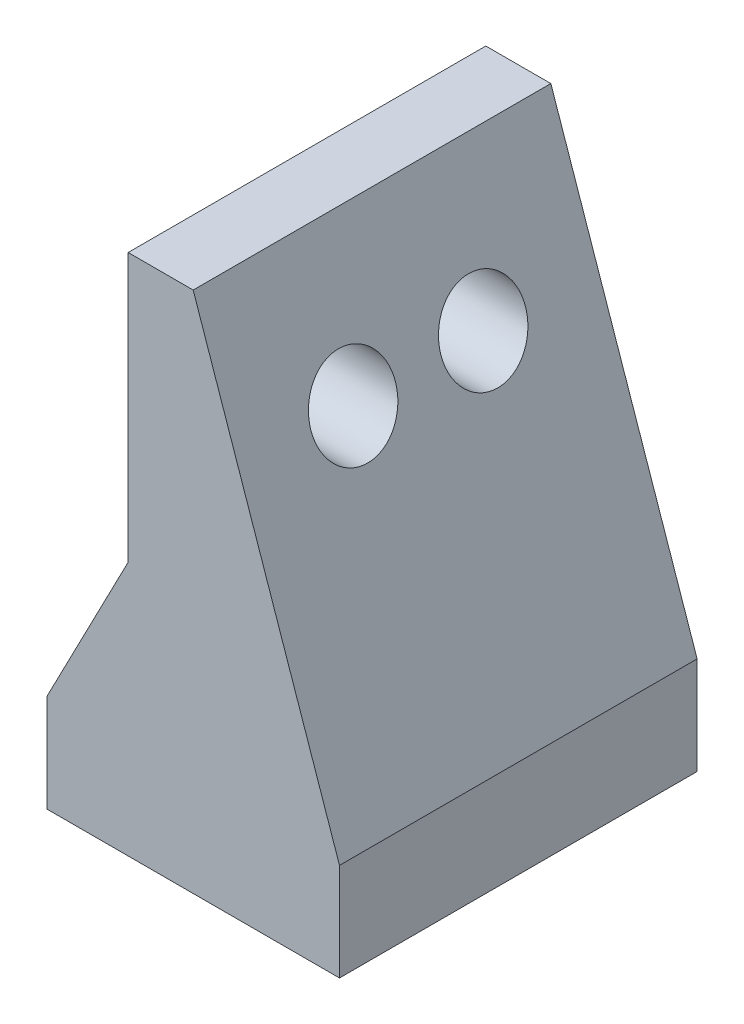
ISO-10303-21;
HEADER;
FILE_DESCRIPTION(('STEP AP214'),'2;1');
FILE_NAME('part.step','',(''),(''),'','','');
FILE_SCHEMA(('AUTOMOTIVE_DESIGN { 1 0 10303 214 1 1 1 1 }'));
ENDSEC;
DATA;
#1=APPLICATION_CONTEXT('core data for automotive mechanical design processes');
#2=APPLICATION_PROTOCOL_DEFINITION('international standard','automotive_design',2000,#1);
#3=PRODUCT_CONTEXT('',#1,'mechanical');
#4=PRODUCT('Part','Part','',(#3));
#5=PRODUCT_RELATED_PRODUCT_CATEGORY('part','',(#4));
#6=PRODUCT_DEFINITION_FORMATION('','',#4);
#7=PRODUCT_DEFINITION_CONTEXT('part definition',#1,'design');
#8=PRODUCT_DEFINITION('design','',#6,#7);
#9=PRODUCT_DEFINITION_SHAPE('','',#8);
#10=(LENGTH_UNIT() NAMED_UNIT(*) SI_UNIT(.MILLI.,.METRE.));
#11=(NAMED_UNIT(*) PLANE_ANGLE_UNIT() SI_UNIT($,.RADIAN.));
#12=(NAMED_UNIT(*) SI_UNIT($,.STERADIAN.) SOLID_ANGLE_UNIT());
#13=UNCERTAINTY_MEASURE_WITH_UNIT(LENGTH_MEASURE(1.E-05),#10,'distance_accuracy_value','');
#14=(GEOMETRIC_REPRESENTATION_CONTEXT(3) GLOBAL_UNCERTAINTY_ASSIGNED_CONTEXT((#13)) GLOBAL_UNIT_ASSIGNED_CONTEXT((#10,
#11,#12)) REPRESENTATION_CONTEXT('',''));
#15=CARTESIAN_POINT('',(0.,0.,0.));
#16=DIRECTION('',(0.,0.,1.));
#17=DIRECTION('',(1.,0.,0.));
#18=AXIS2_PLACEMENT_3D('',#15,#16,#17);
#19=CARTESIAN_POINT('',(18.,0.,22.));
#20=DIRECTION('',(0.,1.,0.));
#21=DIRECTION('',(-1.,0.,0.));
#22=AXIS2_PLACEMENT_3D('',#19,#20,#21);
#23=PLANE('',#22);
#24=CARTESIAN_POINT('',(13.,0.,11.));
#25=DIRECTION('',(0.,1.,0.));
#26=DIRECTION('',(-1.,0.,0.));
#27=AXIS2_PLACEMENT_3D('',#24,#25,#26);
#28=CIRCLE('',#27,3.6);
#29=CARTESIAN_POINT('',(9.4,0.,11.));
#30=VERTEX_POINT('',#29);
#31=EDGE_CURVE('E159',#30,#30,#28,.T.);
#32=ORIENTED_EDGE('',*,*,#31,.T.);
#33=EDGE_LOOP('',(#32));
#34=FACE_BOUND('',#33,.T.);
#35=CARTESIAN_POINT('',(5.,0.,17.));
#36=DIRECTION('',(0.,1.,0.));
#37=DIRECTION('',(-1.,0.,0.));
#38=AXIS2_PLACEMENT_3D('',#35,#36,#37);
#39=CIRCLE('',#38,3.59999999999999);
#40=CARTESIAN_POINT('',(1.40000000000001,0.,17.));
#41=VERTEX_POINT('',#40);
#42=EDGE_CURVE('E156',#41,#41,#39,.T.);
#43=ORIENTED_EDGE('',*,*,#42,.T.);
#44=EDGE_LOOP('',(#43));
#45=FACE_BOUND('',#44,.T.);
#46=CARTESIAN_POINT('',(5.,0.,5.));
#47=DIRECTION('',(0.,1.,0.));
#48=DIRECTION('',(-1.,0.,0.));
#49=AXIS2_PLACEMENT_3D('',#46,#47,#48);
#50=CIRCLE('',#49,3.6);
#51=CARTESIAN_POINT('',(1.4,0.,5.));
#52=VERTEX_POINT('',#51);
#53=EDGE_CURVE('E153',#52,#52,#50,.T.);
#54=ORIENTED_EDGE('',*,*,#53,.T.);
#55=EDGE_LOOP('',(#54));
#56=FACE_BOUND('',#55,.T.);
#57=DIRECTION('',(1.,0.,0.));
#58=VECTOR('',#57,1.);
#59=CARTESIAN_POINT('',(18.,0.,0.));
#60=LINE('',#59,#58);
#61=CARTESIAN_POINT('',(0.,0.,0.));
#62=VERTEX_POINT('',#61);
#63=CARTESIAN_POINT('',(18.,0.,0.));
#64=VERTEX_POINT('',#63);
#65=EDGE_CURVE('E125',#62,#64,#60,.T.);
#66=ORIENTED_EDGE('',*,*,#65,.T.);
#67=DIRECTION('',(0.,0.,-1.));
#68=VECTOR('',#67,1.);
#69=CARTESIAN_POINT('',(18.,0.,22.));
#70=LINE('',#69,#68);
#71=CARTESIAN_POINT('',(18.,0.,22.));
#72=VERTEX_POINT('',#71);
#73=EDGE_CURVE('E148',#72,#64,#70,.T.);
#74=ORIENTED_EDGE('',*,*,#73,.F.);
#75=DIRECTION('',(1.,0.,0.));
#76=VECTOR('',#75,1.);
#77=CARTESIAN_POINT('',(18.,0.,22.));
#78=LINE('',#77,#76);
#79=CARTESIAN_POINT('',(0.,0.,22.));
#80=VERTEX_POINT('',#79);
#81=EDGE_CURVE('E138',#80,#72,#78,.T.);
#82=ORIENTED_EDGE('',*,*,#81,.F.);
#83=DIRECTION('',(0.,0.,-1.));
#84=VECTOR('',#83,1.);
#85=CARTESIAN_POINT('',(0.,0.,22.));
#86=LINE('',#85,#84);
#87=EDGE_CURVE('E121',#80,#62,#86,.T.);
#88=ORIENTED_EDGE('',*,*,#87,.T.);
#89=EDGE_LOOP('',(#66,#74,#82,#88));
#90=FACE_BOUND('',#89,.T.);
#91=ADVANCED_FACE('F33',(#34,#45,#56,#90),#23,.F.);
#92=CARTESIAN_POINT('',(18.,6.,22.));
#93=DIRECTION('',(-1.,0.,0.));
#94=DIRECTION('',(0.,0.,1.));
#95=AXIS2_PLACEMENT_3D('',#92,#93,#94);
#96=PLANE('',#95);
#97=DIRECTION('',(0.,1.,0.));
#98=VECTOR('',#97,1.);
#99=CARTESIAN_POINT('',(18.,6.,0.));
#100=LINE('',#99,#98);
#101=CARTESIAN_POINT('',(18.,6.,0.));
#102=VERTEX_POINT('',#101);
#103=EDGE_CURVE('E128',#64,#102,#100,.T.);
#104=ORIENTED_EDGE('',*,*,#103,.T.);
#105=DIRECTION('',(0.,0.,-1.));
#106=VECTOR('',#105,1.);
#107=CARTESIAN_POINT('',(18.,6.,22.));
#108=LINE('',#107,#106);
#109=CARTESIAN_POINT('',(18.,6.,22.));
#110=VERTEX_POINT('',#109);
#111=EDGE_CURVE('E145',#110,#102,#108,.T.);
#112=ORIENTED_EDGE('',*,*,#111,.F.);
#113=DIRECTION('',(0.,1.,0.));
#114=VECTOR('',#113,1.);
#115=CARTESIAN_POINT('',(18.,6.,22.));
#116=LINE('',#115,#114);
#117=EDGE_CURVE('E91',#72,#110,#116,.T.);
#118=ORIENTED_EDGE('',*,*,#117,.F.);
#119=ORIENTED_EDGE('',*,*,#73,.T.);
#120=EDGE_LOOP('',(#104,#112,#118,#119));
#121=FACE_BOUND('',#120,.T.);
#122=ADVANCED_FACE('F231',(#121),#96,.F.);
#123=CARTESIAN_POINT('',(9.,32.15,22.));
#124=DIRECTION('',(-0.945564949584721,-0.32543344345172,0.));
#125=DIRECTION('',(0.32543344345172,-0.945564949584721,0.));
#126=AXIS2_PLACEMENT_3D('',#123,#124,#125);
#127=PLANE('',#126);
#128=CARTESIAN_POINT('',(11.8393881453155,23.9,15.));
#129=DIRECTION('',(-0.945564949584721,-0.32543344345172,0.));
#130=DIRECTION('',(-0.32543344345172,0.945564949584721,0.));
#131=AXIS2_PLACEMENT_3D('',#128,#129,#130);
#132=ELLIPSE('',#131,2.74967891009696,2.6);
#133=CARTESIAN_POINT('',(10.9445506692161,26.5,15.));
#134=VERTEX_POINT('',#133);
#135=EDGE_CURVE('E192',#134,#134,#132,.T.);
#136=ORIENTED_EDGE('',*,*,#135,.T.);
#137=EDGE_LOOP('',(#136));
#138=FACE_BOUND('',#137,.T.);
#139=CARTESIAN_POINT('',(11.8393881453155,23.9,7.));
#140=DIRECTION('',(-0.945564949584721,-0.32543344345172,0.));
#141=DIRECTION('',(-0.32543344345172,0.945564949584721,0.));
#142=AXIS2_PLACEMENT_3D('',#139,#140,#141);
#143=ELLIPSE('',#142,2.74967891009696,2.6);
#144=CARTESIAN_POINT('',(10.9445506692161,26.5,7.));
#145=VERTEX_POINT('',#144);
#146=EDGE_CURVE('E129',#145,#145,#143,.T.);
#147=ORIENTED_EDGE('',*,*,#146,.T.);
#148=EDGE_LOOP('',(#147));
#149=FACE_BOUND('',#148,.T.);
#150=DIRECTION('',(-0.32543344345172,0.945564949584721,0.));
#151=VECTOR('',#150,1.);
#152=CARTESIAN_POINT('',(9.,32.15,0.));
#153=LINE('',#152,#151);
#154=CARTESIAN_POINT('',(9.,32.15,0.));
#155=VERTEX_POINT('',#154);
#156=EDGE_CURVE('E131',#102,#155,#153,.T.);
#157=ORIENTED_EDGE('',*,*,#156,.T.);
#158=DIRECTION('',(0.,0.,-1.));
#159=VECTOR('',#158,1.);
#160=CARTESIAN_POINT('',(9.,32.15,22.));
#161=LINE('',#160,#159);
#162=CARTESIAN_POINT('',(9.,32.15,22.));
#163=VERTEX_POINT('',#162);
#164=EDGE_CURVE('E142',#163,#155,#161,.T.);
#165=ORIENTED_EDGE('',*,*,#164,.F.);
#166=DIRECTION('',(-0.32543344345172,0.945564949584721,0.));
#167=VECTOR('',#166,1.);
#168=CARTESIAN_POINT('',(9.,32.15,22.));
#169=LINE('',#168,#167);
#170=EDGE_CURVE('E205',#110,#163,#169,.T.);
#171=ORIENTED_EDGE('',*,*,#170,.F.);
#172=ORIENTED_EDGE('',*,*,#111,.T.);
#173=EDGE_LOOP('',(#157,#165,#171,#172));
#174=FACE_BOUND('',#173,.T.);
#175=ADVANCED_FACE('F209',(#138,#149,#174),#127,.F.);
#176=CARTESIAN_POINT('',(5.,32.15,22.));
#177=DIRECTION('',(0.,-1.,0.));
#178=DIRECTION('',(0.,0.,-1.));
#179=AXIS2_PLACEMENT_3D('',#176,#177,#178);
#180=PLANE('',#179);
#181=DIRECTION('',(-1.,0.,0.));
#182=VECTOR('',#181,1.);
#183=CARTESIAN_POINT('',(5.,32.15,0.));
#184=LINE('',#183,#182);
#185=CARTESIAN_POINT('',(5.,32.15,0.));
#186=VERTEX_POINT('',#185);
#187=EDGE_CURVE('E133',#155,#186,#184,.T.);
#188=ORIENTED_EDGE('',*,*,#187,.T.);
#189=DIRECTION('',(0.,0.,-1.));
#190=VECTOR('',#189,1.);
#191=CARTESIAN_POINT('',(5.,32.15,22.));
#192=LINE('',#191,#190);
#193=CARTESIAN_POINT('',(5.,32.15,22.));
#194=VERTEX_POINT('',#193);
#195=EDGE_CURVE('E116',#194,#186,#192,.T.);
#196=ORIENTED_EDGE('',*,*,#195,.F.);
#197=DIRECTION('',(-1.,0.,0.));
#198=VECTOR('',#197,1.);
#199=CARTESIAN_POINT('',(5.,32.15,22.));
#200=LINE('',#199,#198);
#201=EDGE_CURVE('E107',#163,#194,#200,.T.);
#202=ORIENTED_EDGE('',*,*,#201,.F.);
#203=ORIENTED_EDGE('',*,*,#164,.T.);
#204=EDGE_LOOP('',(#188,#196,#202,#203));
#205=FACE_BOUND('',#204,.T.);
#206=ADVANCED_FACE('F213',(#205),#180,.F.);
#207=CARTESIAN_POINT('',(5.,15.65,22.));
#208=DIRECTION('',(1.,0.,0.));
#209=DIRECTION('',(0.,0.,-1.));
#210=AXIS2_PLACEMENT_3D('',#207,#208,#209);
#211=PLANE('',#210);
#212=CARTESIAN_POINT('',(5.,23.9,15.));
#213=DIRECTION('',(1.,0.,0.));
#214=DIRECTION('',(0.,0.,-1.));
#215=AXIS2_PLACEMENT_3D('',#212,#213,#214);
#216=CIRCLE('',#215,3.6);
#217=CARTESIAN_POINT('',(5.,23.9,11.4));
#218=VERTEX_POINT('',#217);
#219=EDGE_CURVE('E42',#218,#218,#216,.T.);
#220=ORIENTED_EDGE('',*,*,#219,.T.);
#221=EDGE_LOOP('',(#220));
#222=FACE_BOUND('',#221,.T.);
#223=CARTESIAN_POINT('',(5.,23.9,7.));
#224=DIRECTION('',(1.,0.,0.));
#225=DIRECTION('',(0.,0.,-1.));
#226=AXIS2_PLACEMENT_3D('',#223,#224,#225);
#227=CIRCLE('',#226,3.6);
#228=CARTESIAN_POINT('',(5.,23.9,3.4));
#229=VERTEX_POINT('',#228);
#230=EDGE_CURVE('E171',#229,#229,#227,.T.);
#231=ORIENTED_EDGE('',*,*,#230,.T.);
#232=EDGE_LOOP('',(#231));
#233=FACE_BOUND('',#232,.T.);
#234=DIRECTION('',(0.,-1.,0.));
#235=VECTOR('',#234,1.);
#236=CARTESIAN_POINT('',(5.,15.65,0.));
#237=LINE('',#236,#235);
#238=CARTESIAN_POINT('',(5.,15.65,0.));
#239=VERTEX_POINT('',#238);
#240=EDGE_CURVE('E115',#186,#239,#237,.T.);
#241=ORIENTED_EDGE('',*,*,#240,.T.);
#242=DIRECTION('',(0.,0.,-1.));
#243=VECTOR('',#242,1.);
#244=CARTESIAN_POINT('',(5.,15.65,22.));
#245=LINE('',#244,#243);
#246=CARTESIAN_POINT('',(5.,15.65,22.));
#247=VERTEX_POINT('',#246);
#248=EDGE_CURVE('E112',#247,#239,#245,.T.);
#249=ORIENTED_EDGE('',*,*,#248,.F.);
#250=DIRECTION('',(0.,-1.,0.));
#251=VECTOR('',#250,1.);
#252=CARTESIAN_POINT('',(5.,15.65,22.));
#253=LINE('',#252,#251);
#254=EDGE_CURVE('E101',#194,#247,#253,.T.);
#255=ORIENTED_EDGE('',*,*,#254,.F.);
#256=ORIENTED_EDGE('',*,*,#195,.T.);
#257=EDGE_LOOP('',(#241,#249,#255,#256));
#258=FACE_BOUND('',#257,.T.);
#259=ADVANCED_FACE('F113',(#222,#233,#258),#211,.F.);
#260=CARTESIAN_POINT('',(0.,6.,22.));
#261=DIRECTION('',(0.887893748771254,-0.460048574492878,0.));
#262=DIRECTION('',(0.460048574492878,0.887893748771254,0.));
#263=AXIS2_PLACEMENT_3D('',#260,#261,#262);
#264=PLANE('',#263);
#265=DIRECTION('',(-0.460048574492878,-0.887893748771254,0.));
#266=VECTOR('',#265,1.);
#267=CARTESIAN_POINT('',(0.,6.,0.));
#268=LINE('',#267,#266);
#269=CARTESIAN_POINT('',(0.,6.,0.));
#270=VERTEX_POINT('',#269);
#271=EDGE_CURVE('E76',#239,#270,#268,.T.);
#272=ORIENTED_EDGE('',*,*,#271,.T.);
#273=DIRECTION('',(0.,0.,-1.));
#274=VECTOR('',#273,1.);
#275=CARTESIAN_POINT('',(0.,6.,22.));
#276=LINE('',#275,#274);
#277=CARTESIAN_POINT('',(0.,6.,22.));
#278=VERTEX_POINT('',#277);
#279=EDGE_CURVE('E117',#278,#270,#276,.T.);
#280=ORIENTED_EDGE('',*,*,#279,.F.);
#281=DIRECTION('',(-0.460048574492878,-0.887893748771254,0.));
#282=VECTOR('',#281,1.);
#283=CARTESIAN_POINT('',(0.,6.,22.));
#284=LINE('',#283,#282);
#285=EDGE_CURVE('E105',#247,#278,#284,.T.);
#286=ORIENTED_EDGE('',*,*,#285,.F.);
#287=ORIENTED_EDGE('',*,*,#248,.T.);
#288=EDGE_LOOP('',(#272,#280,#286,#287));
#289=FACE_BOUND('',#288,.T.);
#290=ADVANCED_FACE('F119',(#289),#264,.F.);
#291=CARTESIAN_POINT('',(0.,0.,22.));
#292=DIRECTION('',(1.,0.,0.));
#293=DIRECTION('',(0.,0.,-1.));
#294=AXIS2_PLACEMENT_3D('',#291,#292,#293);
#295=PLANE('',#294);
#296=DIRECTION('',(0.,-1.,0.));
#297=VECTOR('',#296,1.);
#298=CARTESIAN_POINT('',(0.,0.,0.));
#299=LINE('',#298,#297);
#300=EDGE_CURVE('E82',#270,#62,#299,.T.);
#301=ORIENTED_EDGE('',*,*,#300,.T.);
#302=ORIENTED_EDGE('',*,*,#87,.F.);
#303=DIRECTION('',(0.,-1.,0.));
#304=VECTOR('',#303,1.);
#305=CARTESIAN_POINT('',(0.,0.,22.));
#306=LINE('',#305,#304);
#307=EDGE_CURVE('E50',#278,#80,#306,.T.);
#308=ORIENTED_EDGE('',*,*,#307,.F.);
#309=ORIENTED_EDGE('',*,*,#279,.T.);
#310=EDGE_LOOP('',(#301,#302,#308,#309));
#311=FACE_BOUND('',#310,.T.);
#312=ADVANCED_FACE('F220',(#311),#295,.F.);
#313=CARTESIAN_POINT('',(0.,0.,22.));
#314=DIRECTION('',(0.,0.,-1.));
#315=DIRECTION('',(-1.,0.,0.));
#316=AXIS2_PLACEMENT_3D('',#313,#314,#315);
#317=PLANE('',#316);
#318=ORIENTED_EDGE('',*,*,#81,.T.);
#319=ORIENTED_EDGE('',*,*,#117,.T.);
#320=ORIENTED_EDGE('',*,*,#170,.T.);
#321=ORIENTED_EDGE('',*,*,#201,.T.);
#322=ORIENTED_EDGE('',*,*,#254,.T.);
#323=ORIENTED_EDGE('',*,*,#285,.T.);
#324=ORIENTED_EDGE('',*,*,#307,.T.);
#325=EDGE_LOOP('',(#318,#319,#320,#321,#322,#323,#324));
#326=FACE_BOUND('',#325,.T.);
#327=ADVANCED_FACE('F103',(#326),#317,.F.);
#328=CARTESIAN_POINT('',(0.,0.,0.));
#329=DIRECTION('',(0.,0.,-1.));
#330=DIRECTION('',(-1.,0.,0.));
#331=AXIS2_PLACEMENT_3D('',#328,#329,#330);
#332=PLANE('',#331);
#333=ORIENTED_EDGE('',*,*,#65,.F.);
#334=ORIENTED_EDGE('',*,*,#300,.F.);
#335=ORIENTED_EDGE('',*,*,#271,.F.);
#336=ORIENTED_EDGE('',*,*,#240,.F.);
#337=ORIENTED_EDGE('',*,*,#187,.F.);
#338=ORIENTED_EDGE('',*,*,#156,.F.);
#339=ORIENTED_EDGE('',*,*,#103,.F.);
#340=EDGE_LOOP('',(#333,#334,#335,#336,#337,#338,#339));
#341=FACE_BOUND('',#340,.T.);
#342=ADVANCED_FACE('F216',(#341),#332,.T.);
#343=CARTESIAN_POINT('',(18.,23.9,7.));
#344=DIRECTION('',(-1.,0.,0.));
#345=DIRECTION('',(0.,0.,1.));
#346=AXIS2_PLACEMENT_3D('',#343,#344,#345);
#347=CYLINDRICAL_SURFACE('',#346,2.6);
#348=CARTESIAN_POINT('',(6.,23.9,7.));
#349=DIRECTION('',(1.,0.,0.));
#350=DIRECTION('',(0.,0.,-1.));
#351=AXIS2_PLACEMENT_3D('',#348,#349,#350);
#352=CIRCLE('',#351,2.6);
#353=CARTESIAN_POINT('',(6.,23.9,4.4));
#354=VERTEX_POINT('',#353);
#355=EDGE_CURVE('E11',#354,#354,#352,.F.);
#356=ORIENTED_EDGE('',*,*,#355,.T.);
#357=EDGE_LOOP('',(#356));
#358=FACE_BOUND('',#357,.T.);
#359=ORIENTED_EDGE('',*,*,#146,.F.);
#360=EDGE_LOOP('',(#359));
#361=FACE_BOUND('',#360,.T.);
#362=ADVANCED_FACE('F188',(#358,#361),#347,.F.);
#363=CARTESIAN_POINT('',(18.,23.9,15.));
#364=DIRECTION('',(-1.,0.,0.));
#365=DIRECTION('',(0.,0.,1.));
#366=AXIS2_PLACEMENT_3D('',#363,#364,#365);
#367=CYLINDRICAL_SURFACE('',#366,2.6);
#368=CARTESIAN_POINT('',(5.99999999999999,23.9,15.));
#369=DIRECTION('',(1.,0.,0.));
#370=DIRECTION('',(0.,0.,-1.));
#371=AXIS2_PLACEMENT_3D('',#368,#369,#370);
#372=CIRCLE('',#371,2.6);
#373=CARTESIAN_POINT('',(5.99999999999999,23.9,12.4));
#374=VERTEX_POINT('',#373);
#375=EDGE_CURVE('E168',#374,#374,#372,.F.);
#376=ORIENTED_EDGE('',*,*,#375,.T.);
#377=EDGE_LOOP('',(#376));
#378=FACE_BOUND('',#377,.T.);
#379=ORIENTED_EDGE('',*,*,#135,.F.);
#380=EDGE_LOOP('',(#379));
#381=FACE_BOUND('',#380,.T.);
#382=ADVANCED_FACE('F184',(#378,#381),#367,.F.);
#383=CARTESIAN_POINT('',(5.,6.,17.));
#384=DIRECTION('',(0.,-1.,0.));
#385=DIRECTION('',(1.,0.,0.));
#386=AXIS2_PLACEMENT_3D('',#383,#384,#385);
#387=CYLINDRICAL_SURFACE('',#386,2.6);
#388=CARTESIAN_POINT('',(5.,0.999999999999983,17.));
#389=DIRECTION('',(0.,1.,0.));
#390=DIRECTION('',(0.,0.,1.));
#391=AXIS2_PLACEMENT_3D('',#388,#389,#390);
#392=CIRCLE('',#391,2.6);
#393=CARTESIAN_POINT('',(5.,0.999999999999983,19.6));
#394=VERTEX_POINT('',#393);
#395=EDGE_CURVE('E162',#394,#394,#392,.F.);
#396=ORIENTED_EDGE('',*,*,#395,.T.);
#397=EDGE_LOOP('',(#396));
#398=FACE_BOUND('',#397,.T.);
#399=CARTESIAN_POINT('',(5.,6.,17.));
#400=DIRECTION('',(0.,-1.,0.));
#401=DIRECTION('',(1.,0.,0.));
#402=AXIS2_PLACEMENT_3D('',#399,#400,#401);
#403=CIRCLE('',#402,2.6);
#404=CARTESIAN_POINT('',(7.6,6.,17.));
#405=VERTEX_POINT('',#404);
#406=EDGE_CURVE('E194',#405,#405,#403,.T.);
#407=ORIENTED_EDGE('',*,*,#406,.F.);
#408=EDGE_LOOP('',(#407));
#409=FACE_BOUND('',#408,.T.);
#410=ADVANCED_FACE('F187',(#398,#409),#387,.F.);
#411=CARTESIAN_POINT('',(5.,6.,17.));
#412=DIRECTION('',(0.,-1.,0.));
#413=DIRECTION('',(1.,0.,0.));
#414=AXIS2_PLACEMENT_3D('',#411,#412,#413);
#415=PLANE('',#414);
#416=ORIENTED_EDGE('',*,*,#406,.T.);
#417=EDGE_LOOP('',(#416));
#418=FACE_BOUND('',#417,.T.);
#419=ADVANCED_FACE('F274',(#418),#415,.T.);
#420=CARTESIAN_POINT('',(13.,6.,11.));
#421=DIRECTION('',(0.,-1.,0.));
#422=DIRECTION('',(1.,0.,0.));
#423=AXIS2_PLACEMENT_3D('',#420,#421,#422);
#424=CYLINDRICAL_SURFACE('',#423,2.6);
#425=CARTESIAN_POINT('',(13.,1.00000000000001,11.));
#426=DIRECTION('',(0.,1.,0.));
#427=DIRECTION('',(0.,0.,1.));
#428=AXIS2_PLACEMENT_3D('',#425,#426,#427);
#429=CIRCLE('',#428,2.6);
#430=CARTESIAN_POINT('',(13.,1.00000000000001,13.6));
#431=VERTEX_POINT('',#430);
#432=EDGE_CURVE('E150',#431,#431,#429,.F.);
#433=ORIENTED_EDGE('',*,*,#432,.T.);
#434=EDGE_LOOP('',(#433));
#435=FACE_BOUND('',#434,.T.);
#436=CARTESIAN_POINT('',(13.,6.,11.));
#437=DIRECTION('',(0.,-1.,0.));
#438=DIRECTION('',(1.,0.,0.));
#439=AXIS2_PLACEMENT_3D('',#436,#437,#438);
#440=CIRCLE('',#439,2.6);
#441=CARTESIAN_POINT('',(15.6,6.,11.));
#442=VERTEX_POINT('',#441);
#443=EDGE_CURVE('E199',#442,#442,#440,.T.);
#444=ORIENTED_EDGE('',*,*,#443,.F.);
#445=EDGE_LOOP('',(#444));
#446=FACE_BOUND('',#445,.T.);
#447=ADVANCED_FACE('F272',(#435,#446),#424,.F.);
#448=CARTESIAN_POINT('',(13.,6.,11.));
#449=DIRECTION('',(0.,-1.,0.));
#450=DIRECTION('',(1.,0.,0.));
#451=AXIS2_PLACEMENT_3D('',#448,#449,#450);
#452=PLANE('',#451);
#453=ORIENTED_EDGE('',*,*,#443,.T.);
#454=EDGE_LOOP('',(#453));
#455=FACE_BOUND('',#454,.T.);
#456=ADVANCED_FACE('F261',(#455),#452,.T.);
#457=CARTESIAN_POINT('',(5.,6.,5.));
#458=DIRECTION('',(0.,-1.,0.));
#459=DIRECTION('',(1.,0.,0.));
#460=AXIS2_PLACEMENT_3D('',#457,#458,#459);
#461=CYLINDRICAL_SURFACE('',#460,2.6);
#462=CARTESIAN_POINT('',(5.,1.00000000000001,5.));
#463=DIRECTION('',(0.,1.,0.));
#464=DIRECTION('',(0.,0.,1.));
#465=AXIS2_PLACEMENT_3D('',#462,#463,#464);
#466=CIRCLE('',#465,2.6);
#467=CARTESIAN_POINT('',(5.,1.00000000000001,7.6));
#468=VERTEX_POINT('',#467);
#469=EDGE_CURVE('E165',#468,#468,#466,.F.);
#470=ORIENTED_EDGE('',*,*,#469,.T.);
#471=EDGE_LOOP('',(#470));
#472=FACE_BOUND('',#471,.T.);
#473=CARTESIAN_POINT('',(5.,6.,5.));
#474=DIRECTION('',(0.,-1.,0.));
#475=DIRECTION('',(1.,0.,0.));
#476=AXIS2_PLACEMENT_3D('',#473,#474,#475);
#477=CIRCLE('',#476,2.6);
#478=CARTESIAN_POINT('',(7.6,6.,5.));
#479=VERTEX_POINT('',#478);
#480=EDGE_CURVE('E265',#479,#479,#477,.T.);
#481=ORIENTED_EDGE('',*,*,#480,.F.);
#482=EDGE_LOOP('',(#481));
#483=FACE_BOUND('',#482,.T.);
#484=ADVANCED_FACE('F258',(#472,#483),#461,.F.);
#485=CARTESIAN_POINT('',(5.,6.,5.));
#486=DIRECTION('',(0.,-1.,0.));
#487=DIRECTION('',(1.,0.,0.));
#488=AXIS2_PLACEMENT_3D('',#485,#486,#487);
#489=PLANE('',#488);
#490=ORIENTED_EDGE('',*,*,#480,.T.);
#491=EDGE_LOOP('',(#490));
#492=FACE_BOUND('',#491,.T.);
#493=ADVANCED_FACE('F245',(#492),#489,.T.);
#494=CARTESIAN_POINT('',(13.,1.00000000000001,11.));
#495=DIRECTION('',(0.,-1.,0.));
#496=DIRECTION('',(0.,0.,-1.));
#497=AXIS2_PLACEMENT_3D('',#494,#495,#496);
#498=CONICAL_SURFACE('',#497,2.6,0.785398163397447);
#499=ORIENTED_EDGE('',*,*,#31,.F.);
#500=EDGE_LOOP('',(#499));
#501=FACE_BOUND('',#500,.T.);
#502=ORIENTED_EDGE('',*,*,#432,.F.);
#503=EDGE_LOOP('',(#502));
#504=FACE_BOUND('',#503,.T.);
#505=ADVANCED_FACE('F241',(#501,#504),#498,.F.);
#506=CARTESIAN_POINT('',(5.,0.999999999999983,17.));
#507=DIRECTION('',(0.,-1.,0.));
#508=DIRECTION('',(0.,0.,-1.));
#509=AXIS2_PLACEMENT_3D('',#506,#507,#508);
#510=CONICAL_SURFACE('',#509,2.6,0.785398163397452);
#511=ORIENTED_EDGE('',*,*,#42,.F.);
#512=EDGE_LOOP('',(#511));
#513=FACE_BOUND('',#512,.T.);
#514=ORIENTED_EDGE('',*,*,#395,.F.);
#515=EDGE_LOOP('',(#514));
#516=FACE_BOUND('',#515,.T.);
#517=ADVANCED_FACE('F244',(#513,#516),#510,.F.);
#518=CARTESIAN_POINT('',(5.,1.00000000000001,5.));
#519=DIRECTION('',(0.,-1.,0.));
#520=DIRECTION('',(0.,0.,-1.));
#521=AXIS2_PLACEMENT_3D('',#518,#519,#520);
#522=CONICAL_SURFACE('',#521,2.6,0.785398163397448);
#523=ORIENTED_EDGE('',*,*,#53,.F.);
#524=EDGE_LOOP('',(#523));
#525=FACE_BOUND('',#524,.T.);
#526=ORIENTED_EDGE('',*,*,#469,.F.);
#527=EDGE_LOOP('',(#526));
#528=FACE_BOUND('',#527,.T.);
#529=ADVANCED_FACE('F181',(#525,#528),#522,.F.);
#530=CARTESIAN_POINT('',(5.99999999999999,23.9,15.));
#531=DIRECTION('',(-1.,0.,0.));
#532=DIRECTION('',(0.,0.,1.));
#533=AXIS2_PLACEMENT_3D('',#530,#531,#532);
#534=CONICAL_SURFACE('',#533,2.6,0.785398163397451);
#535=ORIENTED_EDGE('',*,*,#219,.F.);
#536=EDGE_LOOP('',(#535));
#537=FACE_BOUND('',#536,.T.);
#538=ORIENTED_EDGE('',*,*,#375,.F.);
#539=EDGE_LOOP('',(#538));
#540=FACE_BOUND('',#539,.T.);
#541=ADVANCED_FACE('F178',(#537,#540),#534,.F.);
#542=CARTESIAN_POINT('',(6.,23.9,7.));
#543=DIRECTION('',(-1.,0.,0.));
#544=DIRECTION('',(0.,0.,1.));
#545=AXIS2_PLACEMENT_3D('',#542,#543,#544);
#546=CONICAL_SURFACE('',#545,2.6,0.785398163397451);
#547=ORIENTED_EDGE('',*,*,#230,.F.);
#548=EDGE_LOOP('',(#547));
#549=FACE_BOUND('',#548,.T.);
#550=ORIENTED_EDGE('',*,*,#355,.F.);
#551=EDGE_LOOP('',(#550));
#552=FACE_BOUND('',#551,.T.);
#553=ADVANCED_FACE('F35',(#549,#552),#546,.F.);
#554=CLOSED_SHELL('',(#91,#122,#175,#206,#259,#290,#312,#327,#342,#362,#382,#410,#419,#447,#456,
#484,#493,#505,#517,#529,#541,#553));
#555=MANIFOLD_SOLID_BREP('B2',#554);
#556=ADVANCED_BREP_SHAPE_REPRESENTATION('',(#18,#555),#14);
#557=SHAPE_DEFINITION_REPRESENTATION(#9,#556);
ENDSEC;
END-ISO-10303-21;
